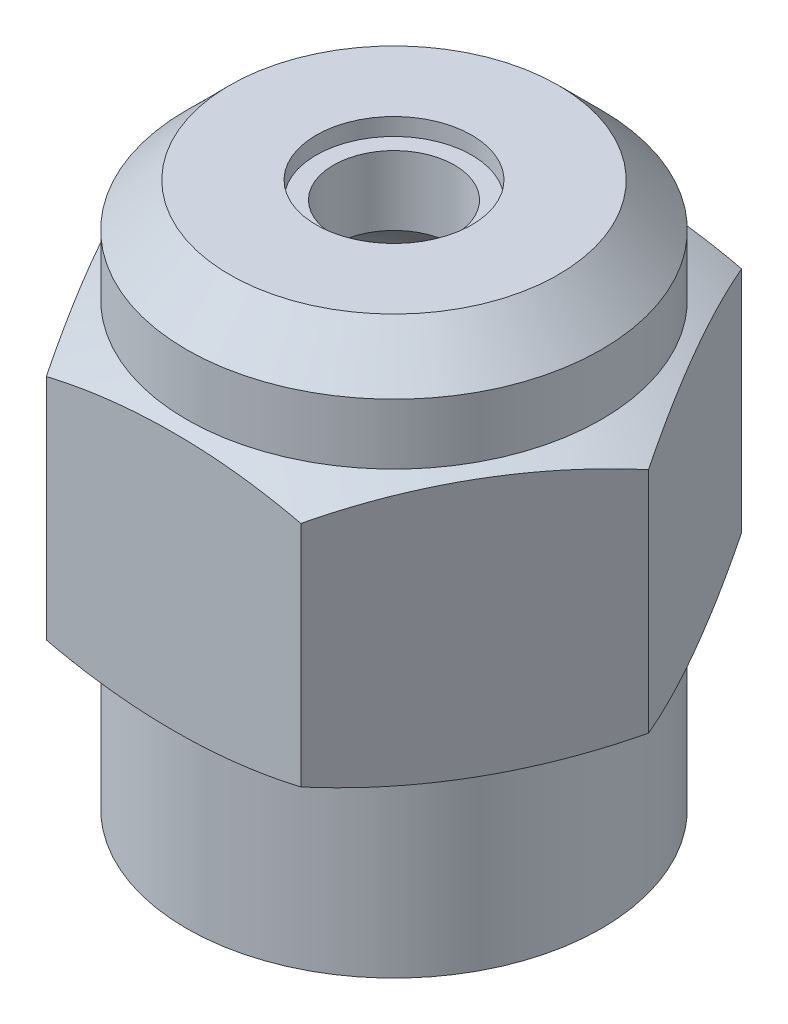
ISO-10303-21;
HEADER;
FILE_DESCRIPTION(('STEP AP214'),'2;1');
FILE_NAME('part.step','',(''),(''),'','','');
FILE_SCHEMA(('AUTOMOTIVE_DESIGN { 1 0 10303 214 1 1 1 1 }'));
ENDSEC;
DATA;
#1=APPLICATION_CONTEXT('core data for automotive mechanical design processes');
#2=APPLICATION_PROTOCOL_DEFINITION('international standard','automotive_design',2000,#1);
#3=PRODUCT_CONTEXT('',#1,'mechanical');
#4=PRODUCT('Part','Part','',(#3));
#5=PRODUCT_RELATED_PRODUCT_CATEGORY('part','',(#4));
#6=PRODUCT_DEFINITION_FORMATION('','',#4);
#7=PRODUCT_DEFINITION_CONTEXT('part definition',#1,'design');
#8=PRODUCT_DEFINITION('design','',#6,#7);
#9=PRODUCT_DEFINITION_SHAPE('','',#8);
#10=(LENGTH_UNIT() NAMED_UNIT(*) SI_UNIT(.MILLI.,.METRE.));
#11=(NAMED_UNIT(*) PLANE_ANGLE_UNIT() SI_UNIT($,.RADIAN.));
#12=(NAMED_UNIT(*) SI_UNIT($,.STERADIAN.) SOLID_ANGLE_UNIT());
#13=UNCERTAINTY_MEASURE_WITH_UNIT(LENGTH_MEASURE(1.E-05),#10,'distance_accuracy_value','');
#14=(GEOMETRIC_REPRESENTATION_CONTEXT(3) GLOBAL_UNCERTAINTY_ASSIGNED_CONTEXT((#13)) GLOBAL_UNIT_ASSIGNED_CONTEXT((#10,
#11,#12)) REPRESENTATION_CONTEXT('',''));
#15=CARTESIAN_POINT('',(0.,0.,0.));
#16=DIRECTION('',(0.,0.,1.));
#17=DIRECTION('',(1.,0.,0.));
#18=AXIS2_PLACEMENT_3D('',#15,#16,#17);
#19=CARTESIAN_POINT('',(0.,0.,0.));
#20=DIRECTION('',(0.,-1.,0.));
#21=DIRECTION('',(0.,0.,-1.));
#22=AXIS2_PLACEMENT_3D('',#19,#20,#21);
#23=CYLINDRICAL_SURFACE('',#22,6.096);
#24=CARTESIAN_POINT('',(0.,0.,0.));
#25=DIRECTION('',(0.,-1.,0.));
#26=DIRECTION('',(0.,0.,-1.));
#27=AXIS2_PLACEMENT_3D('',#24,#25,#26);
#28=CIRCLE('',#27,6.096);
#29=CARTESIAN_POINT('',(0.,0.,-6.096));
#30=VERTEX_POINT('',#29);
#31=EDGE_CURVE('E11',#30,#30,#28,.T.);
#32=ORIENTED_EDGE('',*,*,#31,.F.);
#33=EDGE_LOOP('',(#32));
#34=FACE_BOUND('',#33,.T.);
#35=CARTESIAN_POINT('',(0.,5.08,0.));
#36=DIRECTION('',(0.,-1.,0.));
#37=DIRECTION('',(0.,0.,-1.));
#38=AXIS2_PLACEMENT_3D('',#35,#36,#37);
#39=CIRCLE('',#38,6.096);
#40=CARTESIAN_POINT('',(0.,5.08,-6.096));
#41=VERTEX_POINT('',#40);
#42=EDGE_CURVE('E174',#41,#41,#39,.T.);
#43=ORIENTED_EDGE('',*,*,#42,.T.);
#44=EDGE_LOOP('',(#43));
#45=FACE_BOUND('',#44,.T.);
#46=ADVANCED_FACE('F43',(#34,#45),#23,.T.);
#47=CARTESIAN_POINT('',(6.096,0.,0.));
#48=DIRECTION('',(0.,1.,0.));
#49=DIRECTION('',(0.,0.,1.));
#50=AXIS2_PLACEMENT_3D('',#47,#48,#49);
#51=PLANE('',#50);
#52=CARTESIAN_POINT('',(0.,0.,0.));
#53=DIRECTION('',(0.,-1.,0.));
#54=DIRECTION('',(0.,0.,-1.));
#55=AXIS2_PLACEMENT_3D('',#52,#53,#54);
#56=CIRCLE('',#55,4.191);
#57=CARTESIAN_POINT('',(0.,0.,-4.191));
#58=VERTEX_POINT('',#57);
#59=EDGE_CURVE('E121',#58,#58,#56,.T.);
#60=ORIENTED_EDGE('',*,*,#59,.F.);
#61=EDGE_LOOP('',(#60));
#62=FACE_BOUND('',#61,.T.);
#63=ORIENTED_EDGE('',*,*,#31,.T.);
#64=EDGE_LOOP('',(#63));
#65=FACE_BOUND('',#64,.T.);
#66=ADVANCED_FACE('F45',(#62,#65),#51,.F.);
#67=CARTESIAN_POINT('',(0.,12.954,0.));
#68=DIRECTION('',(0.,-1.,0.));
#69=DIRECTION('',(0.,0.,-1.));
#70=AXIS2_PLACEMENT_3D('',#67,#68,#69);
#71=CIRCLE('',#70,6.096);
#72=CARTESIAN_POINT('',(0.,12.954,-6.096));
#73=VERTEX_POINT('',#72);
#74=EDGE_CURVE('E183',#73,#73,#71,.T.);
#75=ORIENTED_EDGE('',*,*,#74,.F.);
#76=EDGE_LOOP('',(#75));
#77=FACE_BOUND('',#76,.T.);
#78=CARTESIAN_POINT('',(0.,14.732,0.));
#79=DIRECTION('',(0.,-1.,0.));
#80=DIRECTION('',(0.,0.,-1.));
#81=AXIS2_PLACEMENT_3D('',#78,#79,#80);
#82=CIRCLE('',#81,6.096);
#83=CARTESIAN_POINT('',(0.,14.732,-6.096));
#84=VERTEX_POINT('',#83);
#85=EDGE_CURVE('E51',#84,#84,#82,.T.);
#86=ORIENTED_EDGE('',*,*,#85,.T.);
#87=EDGE_LOOP('',(#86));
#88=FACE_BOUND('',#87,.T.);
#89=ADVANCED_FACE('F149',(#77,#88),#23,.T.);
#90=CARTESIAN_POINT('',(0.,14.732,0.));
#91=DIRECTION('',(0.,-1.,0.));
#92=DIRECTION('',(0.,0.,-1.));
#93=AXIS2_PLACEMENT_3D('',#90,#91,#92);
#94=CONICAL_SURFACE('',#93,6.096,0.785398163397448);
#95=CARTESIAN_POINT('',(0.,16.002,0.));
#96=DIRECTION('',(0.,-1.,0.));
#97=DIRECTION('',(0.,0.,-1.));
#98=AXIS2_PLACEMENT_3D('',#95,#96,#97);
#99=CIRCLE('',#98,4.826);
#100=CARTESIAN_POINT('',(0.,16.002,-4.826));
#101=VERTEX_POINT('',#100);
#102=EDGE_CURVE('E144',#101,#101,#99,.T.);
#103=ORIENTED_EDGE('',*,*,#102,.T.);
#104=EDGE_LOOP('',(#103));
#105=FACE_BOUND('',#104,.T.);
#106=ORIENTED_EDGE('',*,*,#85,.F.);
#107=EDGE_LOOP('',(#106));
#108=FACE_BOUND('',#107,.T.);
#109=ADVANCED_FACE('F151',(#105,#108),#94,.T.);
#110=CARTESIAN_POINT('',(4.826,16.002,0.));
#111=DIRECTION('',(0.,1.,0.));
#112=DIRECTION('',(0.,0.,1.));
#113=AXIS2_PLACEMENT_3D('',#110,#111,#112);
#114=PLANE('',#113);
#115=CARTESIAN_POINT('',(0.,16.002,0.));
#116=DIRECTION('',(0.,-1.,0.));
#117=DIRECTION('',(0.,0.,-1.));
#118=AXIS2_PLACEMENT_3D('',#115,#116,#117);
#119=CIRCLE('',#118,2.286);
#120=CARTESIAN_POINT('',(0.,16.002,-2.286));
#121=VERTEX_POINT('',#120);
#122=EDGE_CURVE('E141',#121,#121,#119,.T.);
#123=ORIENTED_EDGE('',*,*,#122,.T.);
#124=EDGE_LOOP('',(#123));
#125=FACE_BOUND('',#124,.T.);
#126=ORIENTED_EDGE('',*,*,#102,.F.);
#127=EDGE_LOOP('',(#126));
#128=FACE_BOUND('',#127,.T.);
#129=ADVANCED_FACE('F153',(#125,#128),#114,.T.);
#130=CARTESIAN_POINT('',(0.,0.,0.));
#131=DIRECTION('',(0.,-1.,0.));
#132=DIRECTION('',(0.,0.,-1.));
#133=AXIS2_PLACEMENT_3D('',#130,#131,#132);
#134=CYLINDRICAL_SURFACE('',#133,2.286);
#135=ORIENTED_EDGE('',*,*,#122,.F.);
#136=EDGE_LOOP('',(#135));
#137=FACE_BOUND('',#136,.T.);
#138=CARTESIAN_POINT('',(0.,15.494,0.));
#139=DIRECTION('',(0.,-1.,0.));
#140=DIRECTION('',(0.,0.,-1.));
#141=AXIS2_PLACEMENT_3D('',#138,#139,#140);
#142=CIRCLE('',#141,2.286);
#143=CARTESIAN_POINT('',(0.,15.494,-2.286));
#144=VERTEX_POINT('',#143);
#145=EDGE_CURVE('E138',#144,#144,#142,.T.);
#146=ORIENTED_EDGE('',*,*,#145,.T.);
#147=EDGE_LOOP('',(#146));
#148=FACE_BOUND('',#147,.T.);
#149=ADVANCED_FACE('F160',(#137,#148),#134,.F.);
#150=CARTESIAN_POINT('',(1.778,15.494,0.));
#151=DIRECTION('',(0.,-1.,0.));
#152=DIRECTION('',(0.,0.,-1.));
#153=AXIS2_PLACEMENT_3D('',#150,#151,#152);
#154=PLANE('',#153);
#155=ORIENTED_EDGE('',*,*,#145,.F.);
#156=EDGE_LOOP('',(#155));
#157=FACE_BOUND('',#156,.T.);
#158=CARTESIAN_POINT('',(0.,15.494,0.));
#159=DIRECTION('',(0.,-1.,0.));
#160=DIRECTION('',(0.,0.,-1.));
#161=AXIS2_PLACEMENT_3D('',#158,#159,#160);
#162=CIRCLE('',#161,1.778);
#163=CARTESIAN_POINT('',(0.,15.494,-1.778));
#164=VERTEX_POINT('',#163);
#165=EDGE_CURVE('E135',#164,#164,#162,.T.);
#166=ORIENTED_EDGE('',*,*,#165,.T.);
#167=EDGE_LOOP('',(#166));
#168=FACE_BOUND('',#167,.T.);
#169=ADVANCED_FACE('F240',(#157,#168),#154,.F.);
#170=CARTESIAN_POINT('',(0.,0.,0.));
#171=DIRECTION('',(0.,-1.,0.));
#172=DIRECTION('',(0.,0.,-1.));
#173=AXIS2_PLACEMENT_3D('',#170,#171,#172);
#174=CYLINDRICAL_SURFACE('',#173,1.778);
#175=CARTESIAN_POINT('',(0.,13.462,0.));
#176=DIRECTION('',(0.,-1.,0.));
#177=DIRECTION('',(0.,0.,-1.));
#178=AXIS2_PLACEMENT_3D('',#175,#176,#177);
#179=CIRCLE('',#178,1.778);
#180=CARTESIAN_POINT('',(0.,13.462,-1.778));
#181=VERTEX_POINT('',#180);
#182=EDGE_CURVE('E132',#181,#181,#179,.T.);
#183=ORIENTED_EDGE('',*,*,#182,.T.);
#184=EDGE_LOOP('',(#183));
#185=FACE_BOUND('',#184,.T.);
#186=ORIENTED_EDGE('',*,*,#165,.F.);
#187=EDGE_LOOP('',(#186));
#188=FACE_BOUND('',#187,.T.);
#189=ADVANCED_FACE('F236',(#185,#188),#174,.F.);
#190=CARTESIAN_POINT('',(0.,9.66684558943908,0.));
#191=DIRECTION('',(0.,-1.,0.));
#192=DIRECTION('',(1.,0.,0.));
#193=AXIS2_PLACEMENT_3D('',#190,#191,#192);
#194=SPHERICAL_SURFACE('',#193,4.191);
#195=ORIENTED_EDGE('',*,*,#182,.F.);
#196=EDGE_LOOP('',(#195));
#197=FACE_BOUND('',#196,.T.);
#198=CARTESIAN_POINT('',(0.,9.66684558943908,0.));
#199=DIRECTION('',(0.,-1.,0.));
#200=DIRECTION('',(0.,0.,-1.));
#201=AXIS2_PLACEMENT_3D('',#198,#199,#200);
#202=CIRCLE('',#201,4.191);
#203=CARTESIAN_POINT('',(0.,9.66684558943908,-4.191));
#204=VERTEX_POINT('',#203);
#205=EDGE_CURVE('E129',#204,#204,#202,.T.);
#206=ORIENTED_EDGE('',*,*,#205,.T.);
#207=EDGE_LOOP('',(#206));
#208=FACE_BOUND('',#207,.T.);
#209=ADVANCED_FACE('F232',(#197,#208),#194,.F.);
#210=CARTESIAN_POINT('',(0.,0.,0.));
#211=DIRECTION('',(0.,-1.,0.));
#212=DIRECTION('',(0.,0.,-1.));
#213=AXIS2_PLACEMENT_3D('',#210,#211,#212);
#214=CYLINDRICAL_SURFACE('',#213,4.191);
#215=ORIENTED_EDGE('',*,*,#205,.F.);
#216=EDGE_LOOP('',(#215));
#217=FACE_BOUND('',#216,.T.);
#218=ORIENTED_EDGE('',*,*,#59,.T.);
#219=EDGE_LOOP('',(#218));
#220=FACE_BOUND('',#219,.T.);
#221=ADVANCED_FACE('F229',(#217,#220),#214,.F.);
#222=CARTESIAN_POINT('',(-7.47899538708241,5.08,0.));
#223=DIRECTION('',(0.866025403784439,0.,0.5));
#224=DIRECTION('',(0.5,0.,-0.866025403784438));
#225=AXIS2_PLACEMENT_3D('',#222,#223,#224);
#226=PLANE('',#225);
#227=DIRECTION('',(0.,1.,0.));
#228=VECTOR('',#227,1.);
#229=CARTESIAN_POINT('',(-3.7394976935412,5.08,-6.477));
#230=LINE('',#229,#228);
#231=CARTESIAN_POINT('',(-3.7394976935412,5.6642,-6.477));
#232=VERTEX_POINT('',#231);
#233=CARTESIAN_POINT('',(-3.7394976935412,12.3698,-6.477));
#234=VERTEX_POINT('',#233);
#235=EDGE_CURVE('E119',#232,#234,#230,.T.);
#236=ORIENTED_EDGE('',*,*,#235,.F.);
#237=CARTESIAN_POINT('',(-5.60924654031181,21.4403608695652,-3.2385));
#238=DIRECTION('',(0.866025403784439,0.,0.5));
#239=DIRECTION('',(0.5,0.,-0.866025403784438));
#240=AXIS2_PLACEMENT_3D('',#237,#238,#239);
#241=CIRCLE('',#240,16.213299935004);
#242=CARTESIAN_POINT('',(-7.47899538708241,5.6642,0.));
#243=VERTEX_POINT('',#242);
#244=EDGE_CURVE('E101',#232,#243,#241,.F.);
#245=ORIENTED_EDGE('',*,*,#244,.T.);
#246=DIRECTION('',(0.,1.,0.));
#247=VECTOR('',#246,1.);
#248=CARTESIAN_POINT('',(-7.47899538708241,5.08,0.));
#249=LINE('',#248,#247);
#250=CARTESIAN_POINT('',(-7.47899538708241,12.3698,0.));
#251=VERTEX_POINT('',#250);
#252=EDGE_CURVE('E66',#243,#251,#249,.T.);
#253=ORIENTED_EDGE('',*,*,#252,.T.);
#254=CARTESIAN_POINT('',(-5.60924654031181,-3.40636086956523,-3.2385));
#255=DIRECTION('',(0.866025403784439,0.,0.5));
#256=DIRECTION('',(0.5,0.,-0.866025403784438));
#257=AXIS2_PLACEMENT_3D('',#254,#255,#256);
#258=CIRCLE('',#257,16.213299935004);
#259=EDGE_CURVE('E198',#251,#234,#258,.F.);
#260=ORIENTED_EDGE('',*,*,#259,.T.);
#261=EDGE_LOOP('',(#236,#245,#253,#260));
#262=FACE_BOUND('',#261,.T.);
#263=ADVANCED_FACE('F226',(#262),#226,.F.);
#264=CARTESIAN_POINT('',(-3.7394976935412,5.08,-6.477));
#265=DIRECTION('',(0.,0.,1.));
#266=DIRECTION('',(1.,0.,0.));
#267=AXIS2_PLACEMENT_3D('',#264,#265,#266);
#268=PLANE('',#267);
#269=DIRECTION('',(0.,1.,0.));
#270=VECTOR('',#269,1.);
#271=CARTESIAN_POINT('',(3.73949769354121,5.08,-6.477));
#272=LINE('',#271,#270);
#273=CARTESIAN_POINT('',(3.73949769354121,5.6642,-6.477));
#274=VERTEX_POINT('',#273);
#275=CARTESIAN_POINT('',(3.73949769354121,12.3698,-6.477));
#276=VERTEX_POINT('',#275);
#277=EDGE_CURVE('E110',#274,#276,#272,.T.);
#278=ORIENTED_EDGE('',*,*,#277,.F.);
#279=CARTESIAN_POINT('',(0.,21.4403608695652,-6.477));
#280=DIRECTION('',(0.,0.,1.));
#281=DIRECTION('',(1.,0.,0.));
#282=AXIS2_PLACEMENT_3D('',#279,#280,#281);
#283=CIRCLE('',#282,16.213299935004);
#284=EDGE_CURVE('E96',#274,#232,#283,.F.);
#285=ORIENTED_EDGE('',*,*,#284,.T.);
#286=ORIENTED_EDGE('',*,*,#235,.T.);
#287=CARTESIAN_POINT('',(0.,-3.40636086956523,-6.477));
#288=DIRECTION('',(0.,0.,1.));
#289=DIRECTION('',(1.,0.,0.));
#290=AXIS2_PLACEMENT_3D('',#287,#288,#289);
#291=CIRCLE('',#290,16.213299935004);
#292=EDGE_CURVE('E118',#234,#276,#291,.F.);
#293=ORIENTED_EDGE('',*,*,#292,.T.);
#294=EDGE_LOOP('',(#278,#285,#286,#293));
#295=FACE_BOUND('',#294,.T.);
#296=ADVANCED_FACE('F116',(#295),#268,.F.);
#297=CARTESIAN_POINT('',(3.73949769354121,5.08,-6.477));
#298=DIRECTION('',(-0.866025403784439,0.,0.5));
#299=DIRECTION('',(0.5,0.,0.866025403784439));
#300=AXIS2_PLACEMENT_3D('',#297,#298,#299);
#301=PLANE('',#300);
#302=DIRECTION('',(0.,1.,0.));
#303=VECTOR('',#302,1.);
#304=CARTESIAN_POINT('',(7.47899538708241,5.08,0.));
#305=LINE('',#304,#303);
#306=CARTESIAN_POINT('',(7.47899538708241,5.6642,0.));
#307=VERTEX_POINT('',#306);
#308=CARTESIAN_POINT('',(7.47899538708241,12.3698,0.));
#309=VERTEX_POINT('',#308);
#310=EDGE_CURVE('E112',#307,#309,#305,.T.);
#311=ORIENTED_EDGE('',*,*,#310,.F.);
#312=CARTESIAN_POINT('',(5.60924654031181,21.4403608695652,-3.2385));
#313=DIRECTION('',(-0.866025403784439,0.,0.5));
#314=DIRECTION('',(0.5,0.,0.866025403784439));
#315=AXIS2_PLACEMENT_3D('',#312,#313,#314);
#316=CIRCLE('',#315,16.213299935004);
#317=EDGE_CURVE('E99',#307,#274,#316,.F.);
#318=ORIENTED_EDGE('',*,*,#317,.T.);
#319=ORIENTED_EDGE('',*,*,#277,.T.);
#320=CARTESIAN_POINT('',(5.60924654031181,-3.40636086956523,-3.2385));
#321=DIRECTION('',(-0.866025403784439,0.,0.5));
#322=DIRECTION('',(0.5,0.,0.866025403784439));
#323=AXIS2_PLACEMENT_3D('',#320,#321,#322);
#324=CIRCLE('',#323,16.213299935004);
#325=EDGE_CURVE('E195',#276,#309,#324,.F.);
#326=ORIENTED_EDGE('',*,*,#325,.T.);
#327=EDGE_LOOP('',(#311,#318,#319,#326));
#328=FACE_BOUND('',#327,.T.);
#329=ADVANCED_FACE('F108',(#328),#301,.F.);
#330=CARTESIAN_POINT('',(7.47899538708241,5.08,0.));
#331=DIRECTION('',(-0.866025403784439,0.,-0.5));
#332=DIRECTION('',(-0.5,0.,0.866025403784439));
#333=AXIS2_PLACEMENT_3D('',#330,#331,#332);
#334=PLANE('',#333);
#335=DIRECTION('',(0.,1.,0.));
#336=VECTOR('',#335,1.);
#337=CARTESIAN_POINT('',(3.73949769354121,5.08,6.477));
#338=LINE('',#337,#336);
#339=CARTESIAN_POINT('',(3.73949769354121,5.6642,6.477));
#340=VERTEX_POINT('',#339);
#341=CARTESIAN_POINT('',(3.73949769354121,12.3698,6.477));
#342=VERTEX_POINT('',#341);
#343=EDGE_CURVE('E123',#340,#342,#338,.T.);
#344=ORIENTED_EDGE('',*,*,#343,.F.);
#345=CARTESIAN_POINT('',(5.60924654031181,21.4403608695652,3.2385));
#346=DIRECTION('',(-0.866025403784439,0.,-0.5));
#347=DIRECTION('',(-0.5,0.,0.866025403784439));
#348=AXIS2_PLACEMENT_3D('',#345,#346,#347);
#349=CIRCLE('',#348,16.213299935004);
#350=EDGE_CURVE('E113',#340,#307,#349,.F.);
#351=ORIENTED_EDGE('',*,*,#350,.T.);
#352=ORIENTED_EDGE('',*,*,#310,.T.);
#353=CARTESIAN_POINT('',(5.60924654031181,-3.40636086956523,3.2385));
#354=DIRECTION('',(-0.866025403784439,0.,-0.5));
#355=DIRECTION('',(-0.5,0.,0.866025403784439));
#356=AXIS2_PLACEMENT_3D('',#353,#354,#355);
#357=CIRCLE('',#356,16.213299935004);
#358=EDGE_CURVE('E192',#309,#342,#357,.F.);
#359=ORIENTED_EDGE('',*,*,#358,.T.);
#360=EDGE_LOOP('',(#344,#351,#352,#359));
#361=FACE_BOUND('',#360,.T.);
#362=ADVANCED_FACE('F212',(#361),#334,.F.);
#363=CARTESIAN_POINT('',(3.73949769354121,5.08,6.477));
#364=DIRECTION('',(0.,0.,-1.));
#365=DIRECTION('',(-1.,0.,0.));
#366=AXIS2_PLACEMENT_3D('',#363,#364,#365);
#367=PLANE('',#366);
#368=DIRECTION('',(0.,1.,0.));
#369=VECTOR('',#368,1.);
#370=CARTESIAN_POINT('',(-3.73949769354121,5.08,6.477));
#371=LINE('',#370,#369);
#372=CARTESIAN_POINT('',(-3.73949769354121,5.6642,6.477));
#373=VERTEX_POINT('',#372);
#374=CARTESIAN_POINT('',(-3.73949769354121,12.3698,6.477));
#375=VERTEX_POINT('',#374);
#376=EDGE_CURVE('E201',#373,#375,#371,.T.);
#377=ORIENTED_EDGE('',*,*,#376,.F.);
#378=CARTESIAN_POINT('',(0.,21.4403608695652,6.477));
#379=DIRECTION('',(0.,0.,-1.));
#380=DIRECTION('',(-1.,0.,0.));
#381=AXIS2_PLACEMENT_3D('',#378,#379,#380);
#382=CIRCLE('',#381,16.213299935004);
#383=EDGE_CURVE('E58',#373,#340,#382,.F.);
#384=ORIENTED_EDGE('',*,*,#383,.T.);
#385=ORIENTED_EDGE('',*,*,#343,.T.);
#386=CARTESIAN_POINT('',(0.,-3.40636086956523,6.477));
#387=DIRECTION('',(0.,0.,-1.));
#388=DIRECTION('',(-1.,0.,0.));
#389=AXIS2_PLACEMENT_3D('',#386,#387,#388);
#390=CIRCLE('',#389,16.213299935004);
#391=EDGE_CURVE('E189',#342,#375,#390,.F.);
#392=ORIENTED_EDGE('',*,*,#391,.T.);
#393=EDGE_LOOP('',(#377,#384,#385,#392));
#394=FACE_BOUND('',#393,.T.);
#395=ADVANCED_FACE('F206',(#394),#367,.F.);
#396=CARTESIAN_POINT('',(-3.73949769354121,5.08,6.477));
#397=DIRECTION('',(0.866025403784439,0.,-0.5));
#398=DIRECTION('',(-0.5,0.,-0.866025403784438));
#399=AXIS2_PLACEMENT_3D('',#396,#397,#398);
#400=PLANE('',#399);
#401=ORIENTED_EDGE('',*,*,#252,.F.);
#402=CARTESIAN_POINT('',(-5.60924654031181,21.4403608695652,3.2385));
#403=DIRECTION('',(0.866025403784439,0.,-0.5));
#404=DIRECTION('',(-0.5,0.,-0.866025403784438));
#405=AXIS2_PLACEMENT_3D('',#402,#403,#404);
#406=CIRCLE('',#405,16.213299935004);
#407=EDGE_CURVE('E176',#243,#373,#406,.F.);
#408=ORIENTED_EDGE('',*,*,#407,.T.);
#409=ORIENTED_EDGE('',*,*,#376,.T.);
#410=CARTESIAN_POINT('',(-5.60924654031181,-3.40636086956523,3.2385));
#411=DIRECTION('',(0.866025403784439,0.,-0.5));
#412=DIRECTION('',(-0.5,0.,-0.866025403784438));
#413=AXIS2_PLACEMENT_3D('',#410,#411,#412);
#414=CIRCLE('',#413,16.213299935004);
#415=EDGE_CURVE('E186',#375,#251,#414,.F.);
#416=ORIENTED_EDGE('',*,*,#415,.T.);
#417=EDGE_LOOP('',(#401,#408,#409,#416));
#418=FACE_BOUND('',#417,.T.);
#419=ADVANCED_FACE('F219',(#418),#400,.F.);
#420=CARTESIAN_POINT('',(0.,-3.40636086956523,0.));
#421=DIRECTION('',(0.,-1.,0.));
#422=DIRECTION('',(1.,0.,0.));
#423=AXIS2_PLACEMENT_3D('',#420,#421,#422);
#424=SPHERICAL_SURFACE('',#423,17.4591701916901);
#425=ORIENTED_EDGE('',*,*,#74,.T.);
#426=EDGE_LOOP('',(#425));
#427=FACE_BOUND('',#426,.T.);
#428=ORIENTED_EDGE('',*,*,#415,.F.);
#429=ORIENTED_EDGE('',*,*,#391,.F.);
#430=ORIENTED_EDGE('',*,*,#358,.F.);
#431=ORIENTED_EDGE('',*,*,#325,.F.);
#432=ORIENTED_EDGE('',*,*,#292,.F.);
#433=ORIENTED_EDGE('',*,*,#259,.F.);
#434=EDGE_LOOP('',(#428,#429,#430,#431,#432,#433));
#435=FACE_BOUND('',#434,.T.);
#436=ADVANCED_FACE('F211',(#427,#435),#424,.T.);
#437=CARTESIAN_POINT('',(0.,21.4403608695652,0.));
#438=DIRECTION('',(0.,1.,0.));
#439=DIRECTION('',(1.,0.,0.));
#440=AXIS2_PLACEMENT_3D('',#437,#438,#439);
#441=SPHERICAL_SURFACE('',#440,17.4591701916901);
#442=ORIENTED_EDGE('',*,*,#42,.F.);
#443=EDGE_LOOP('',(#442));
#444=FACE_BOUND('',#443,.T.);
#445=ORIENTED_EDGE('',*,*,#284,.F.);
#446=ORIENTED_EDGE('',*,*,#317,.F.);
#447=ORIENTED_EDGE('',*,*,#350,.F.);
#448=ORIENTED_EDGE('',*,*,#383,.F.);
#449=ORIENTED_EDGE('',*,*,#407,.F.);
#450=ORIENTED_EDGE('',*,*,#244,.F.);
#451=EDGE_LOOP('',(#445,#446,#447,#448,#449,#450));
#452=FACE_BOUND('',#451,.T.);
#453=ADVANCED_FACE('F98',(#444,#452),#441,.T.);
#454=CLOSED_SHELL('',(#46,#66,#89,#109,#129,#149,#169,#189,#209,#221,#263,#296,#329,#362,#395,
#419,#436,#453));
#455=MANIFOLD_SOLID_BREP('B2',#454);
#456=ADVANCED_BREP_SHAPE_REPRESENTATION('',(#18,#455),#14);
#457=SHAPE_DEFINITION_REPRESENTATION(#9,#456);
ENDSEC;
END-ISO-10303-21;
